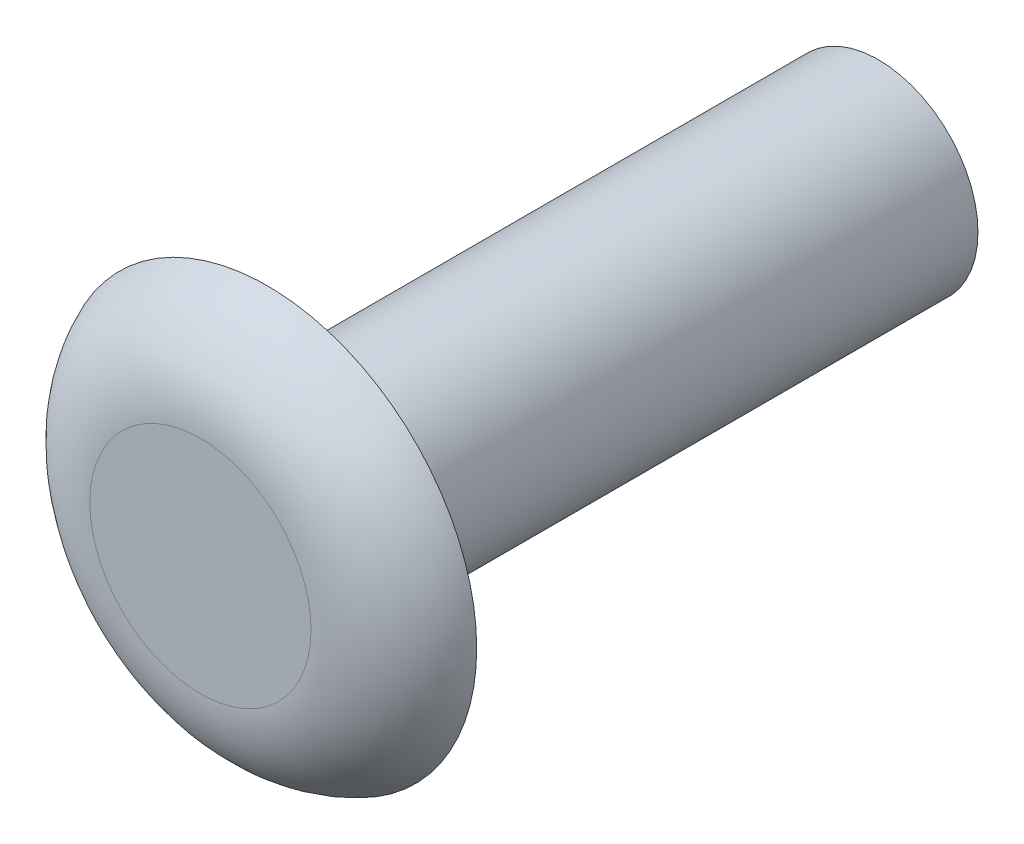
ISO-10303-21;
HEADER;
FILE_DESCRIPTION(('STEP AP214'),'2;1');
FILE_NAME('part.step','',(''),(''),'','','');
FILE_SCHEMA(('AUTOMOTIVE_DESIGN { 1 0 10303 214 1 1 1 1 }'));
ENDSEC;
DATA;
#1=APPLICATION_CONTEXT('core data for automotive mechanical design processes');
#2=APPLICATION_PROTOCOL_DEFINITION('international standard','automotive_design',2000,#1);
#3=PRODUCT_CONTEXT('',#1,'mechanical');
#4=PRODUCT('Part','Part','',(#3));
#5=PRODUCT_RELATED_PRODUCT_CATEGORY('part','',(#4));
#6=PRODUCT_DEFINITION_FORMATION('','',#4);
#7=PRODUCT_DEFINITION_CONTEXT('part definition',#1,'design');
#8=PRODUCT_DEFINITION('design','',#6,#7);
#9=PRODUCT_DEFINITION_SHAPE('','',#8);
#10=(LENGTH_UNIT() NAMED_UNIT(*) SI_UNIT(.MILLI.,.METRE.));
#11=(NAMED_UNIT(*) PLANE_ANGLE_UNIT() SI_UNIT($,.RADIAN.));
#12=(NAMED_UNIT(*) SI_UNIT($,.STERADIAN.) SOLID_ANGLE_UNIT());
#13=UNCERTAINTY_MEASURE_WITH_UNIT(LENGTH_MEASURE(1.E-05),#10,'distance_accuracy_value','');
#14=(GEOMETRIC_REPRESENTATION_CONTEXT(3) GLOBAL_UNCERTAINTY_ASSIGNED_CONTEXT((#13)) GLOBAL_UNIT_ASSIGNED_CONTEXT((#10,
#11,#12)) REPRESENTATION_CONTEXT('',''));
#15=CARTESIAN_POINT('',(0.,0.,0.));
#16=DIRECTION('',(0.,0.,1.));
#17=DIRECTION('',(1.,0.,0.));
#18=AXIS2_PLACEMENT_3D('',#15,#16,#17);
#19=CARTESIAN_POINT('',(0.,0.,1.6002));
#20=DIRECTION('',(0.,0.,1.));
#21=DIRECTION('',(1.,0.,0.));
#22=AXIS2_PLACEMENT_3D('',#19,#20,#21);
#23=PLANE('',#22);
#24=CARTESIAN_POINT('',(0.,0.,1.6002));
#25=DIRECTION('',(0.,0.,1.));
#26=DIRECTION('',(1.,0.,0.));
#27=AXIS2_PLACEMENT_3D('',#24,#25,#26);
#28=CIRCLE('',#27,2.64405934475841);
#29=CARTESIAN_POINT('',(2.64405934475841,0.,1.6002));
#30=VERTEX_POINT('',#29);
#31=EDGE_CURVE('E10',#30,#30,#28,.T.);
#32=ORIENTED_EDGE('',*,*,#31,.T.);
#33=EDGE_LOOP('',(#32));
#34=FACE_BOUND('',#33,.T.);
#35=ADVANCED_FACE('F32',(#34),#23,.T.);
#36=CARTESIAN_POINT('',(0.,0.,0.));
#37=DIRECTION('',(0.,0.,1.));
#38=DIRECTION('',(1.,0.,0.));
#39=AXIS2_PLACEMENT_3D('',#36,#37,#38);
#40=PLANE('',#39);
#41=CARTESIAN_POINT('',(0.,0.,0.));
#42=DIRECTION('',(0.,0.,1.));
#43=DIRECTION('',(1.,0.,0.));
#44=AXIS2_PLACEMENT_3D('',#41,#42,#43);
#45=CIRCLE('',#44,2.38125);
#46=CARTESIAN_POINT('',(2.38125,0.,0.));
#47=VERTEX_POINT('',#46);
#48=EDGE_CURVE('E47',#47,#47,#45,.T.);
#49=ORIENTED_EDGE('',*,*,#48,.T.);
#50=EDGE_LOOP('',(#49));
#51=FACE_BOUND('',#50,.T.);
#52=CARTESIAN_POINT('',(0.,0.,0.));
#53=DIRECTION('',(0.,0.,1.));
#54=DIRECTION('',(1.,0.,0.));
#55=AXIS2_PLACEMENT_3D('',#52,#53,#54);
#56=CIRCLE('',#55,5.0038);
#57=CARTESIAN_POINT('',(5.0038,0.,0.));
#58=VERTEX_POINT('',#57);
#59=EDGE_CURVE('E39',#58,#58,#56,.T.);
#60=ORIENTED_EDGE('',*,*,#59,.F.);
#61=EDGE_LOOP('',(#60));
#62=FACE_BOUND('',#61,.T.);
#63=ADVANCED_FACE('F53',(#51,#62),#40,.F.);
#64=CARTESIAN_POINT('',(0.,0.,-14.605));
#65=DIRECTION('',(0.,0.,1.));
#66=DIRECTION('',(1.,0.,0.));
#67=AXIS2_PLACEMENT_3D('',#64,#65,#66);
#68=CYLINDRICAL_SURFACE('',#67,2.38125);
#69=CARTESIAN_POINT('',(0.,0.,-14.605));
#70=DIRECTION('',(0.,0.,1.));
#71=DIRECTION('',(1.,0.,0.));
#72=AXIS2_PLACEMENT_3D('',#69,#70,#71);
#73=CIRCLE('',#72,2.38125);
#74=CARTESIAN_POINT('',(2.38125,0.,-14.605));
#75=VERTEX_POINT('',#74);
#76=EDGE_CURVE('E43',#75,#75,#73,.T.);
#77=CARTESIAN_POINT('',(2.38125,0.,-14.605));
#78=CARTESIAN_POINT('',(2.38125,0.,-14.4528645833333));
#79=CARTESIAN_POINT('',(2.38125,0.,-14.3007291666667));
#80=CARTESIAN_POINT('',(2.38125,0.,-13.9964583333333));
#81=CARTESIAN_POINT('',(2.38125,0.,-13.8443229166667));
#82=CARTESIAN_POINT('',(2.38125,0.,-13.5400520833333));
#83=CARTESIAN_POINT('',(2.38125,0.,-13.3879166666667));
#84=CARTESIAN_POINT('',(2.38125,0.,-13.0836458333333));
#85=CARTESIAN_POINT('',(2.38125,0.,-12.9315104166667));
#86=CARTESIAN_POINT('',(2.38125,0.,-12.6272395833333));
#87=CARTESIAN_POINT('',(2.38125,0.,-12.4751041666667));
#88=CARTESIAN_POINT('',(2.38125,0.,-12.1708333333333));
#89=CARTESIAN_POINT('',(2.38125,0.,-12.0186979166667));
#90=CARTESIAN_POINT('',(2.38125,0.,-11.7144270833333));
#91=CARTESIAN_POINT('',(2.38125,0.,-11.5622916666667));
#92=CARTESIAN_POINT('',(2.38125,0.,-11.2580208333333));
#93=CARTESIAN_POINT('',(2.38125,0.,-11.1058854166667));
#94=CARTESIAN_POINT('',(2.38125,0.,-10.8016145833333));
#95=CARTESIAN_POINT('',(2.38125,0.,-10.6494791666667));
#96=CARTESIAN_POINT('',(2.38125,0.,-10.3452083333333));
#97=CARTESIAN_POINT('',(2.38125,0.,-10.1930729166667));
#98=CARTESIAN_POINT('',(2.38125,0.,-9.88880208333333));
#99=CARTESIAN_POINT('',(2.38125,0.,-9.73666666666667));
#100=CARTESIAN_POINT('',(2.38125,0.,-9.43239583333333));
#101=CARTESIAN_POINT('',(2.38125,0.,-9.28026041666667));
#102=CARTESIAN_POINT('',(2.38125,0.,-8.97598958333333));
#103=CARTESIAN_POINT('',(2.38125,0.,-8.82385416666667));
#104=CARTESIAN_POINT('',(2.38125,0.,-8.51958333333333));
#105=CARTESIAN_POINT('',(2.38125,0.,-8.36744791666667));
#106=CARTESIAN_POINT('',(2.38125,0.,-8.06317708333333));
#107=CARTESIAN_POINT('',(2.38125,0.,-7.91104166666667));
#108=CARTESIAN_POINT('',(2.38125,0.,-7.60677083333333));
#109=CARTESIAN_POINT('',(2.38125,0.,-7.45463541666667));
#110=CARTESIAN_POINT('',(2.38125,0.,-7.15036458333333));
#111=CARTESIAN_POINT('',(2.38125,0.,-6.99822916666667));
#112=CARTESIAN_POINT('',(2.38125,0.,-6.69395833333333));
#113=CARTESIAN_POINT('',(2.38125,0.,-6.54182291666667));
#114=CARTESIAN_POINT('',(2.38125,0.,-6.23755208333333));
#115=CARTESIAN_POINT('',(2.38125,0.,-6.08541666666667));
#116=CARTESIAN_POINT('',(2.38125,0.,-5.78114583333333));
#117=CARTESIAN_POINT('',(2.38125,0.,-5.62901041666667));
#118=CARTESIAN_POINT('',(2.38125,0.,-5.32473958333333));
#119=CARTESIAN_POINT('',(2.38125,0.,-5.17260416666667));
#120=CARTESIAN_POINT('',(2.38125,0.,-4.86833333333333));
#121=CARTESIAN_POINT('',(2.38125,0.,-4.71619791666667));
#122=CARTESIAN_POINT('',(2.38125,0.,-4.41192708333333));
#123=CARTESIAN_POINT('',(2.38125,0.,-4.25979166666667));
#124=CARTESIAN_POINT('',(2.38125,0.,-3.95552083333333));
#125=CARTESIAN_POINT('',(2.38125,0.,-3.80338541666667));
#126=CARTESIAN_POINT('',(2.38125,0.,-3.49911458333333));
#127=CARTESIAN_POINT('',(2.38125,0.,-3.34697916666667));
#128=CARTESIAN_POINT('',(2.38125,0.,-3.04270833333333));
#129=CARTESIAN_POINT('',(2.38125,0.,-2.89057291666667));
#130=CARTESIAN_POINT('',(2.38125,0.,-2.58630208333333));
#131=CARTESIAN_POINT('',(2.38125,0.,-2.43416666666667));
#132=CARTESIAN_POINT('',(2.38125,0.,-2.12989583333333));
#133=CARTESIAN_POINT('',(2.38125,0.,-1.97776041666667));
#134=CARTESIAN_POINT('',(2.38125,0.,-1.67348958333333));
#135=CARTESIAN_POINT('',(2.38125,0.,-1.52135416666667));
#136=CARTESIAN_POINT('',(2.38125,0.,-1.21708333333333));
#137=CARTESIAN_POINT('',(2.38125,0.,-1.06494791666667));
#138=CARTESIAN_POINT('',(2.38125,0.,-0.760677083333333));
#139=CARTESIAN_POINT('',(2.38125,0.,-0.608541666666666));
#140=CARTESIAN_POINT('',(2.38125,0.,-0.304270833333333));
#141=CARTESIAN_POINT('',(2.38125,0.,-0.152135416666666));
#142=CARTESIAN_POINT('',(2.38125,0.,0.));
#143=B_SPLINE_CURVE_WITH_KNOTS('',3,(#77,#78,#79,#80,#81,#82,#83,#84,#85,#86,#87,#88,#89,#90,
#91,#92,#93,#94,#95,#96,#97,#98,#99,#100,#101,#102,#103,#104,#105,#106,#107,#108,#109,#110,#111,
#112,#113,#114,#115,#116,#117,#118,#119,#120,#121,#122,#123,#124,#125,#126,#127,#128,#129,#130,
#131,#132,#133,#134,#135,#136,#137,#138,#139,#140,#141,#142),.UNSPECIFIED.,.F.,.F.,(4,2,2,2,2,2,
2,2,2,2,2,2,2,2,2,2,2,2,2,2,2,2,2,2,2,2,2,2,2,2,2,2,4),(0.,0.456406249999999,0.912812499999999,
1.36921875,1.825625,2.28203125,2.7384375,3.19484375,3.65125,4.10765625,4.5640625,5.02046875,
5.476875,5.93328125,6.3896875,6.84609375,7.3025,7.75890625,8.2153125,8.67171875,9.128125,
9.58453125,10.0409375,10.49734375,10.95375,11.41015625,11.8665625,12.32296875,12.779375,
13.23578125,13.6921875,14.14859375,14.605),.UNSPECIFIED.);
#144=EDGE_CURVE('BSEAM56',#75,#47,#143,.T.);
#145=ORIENTED_EDGE('',*,*,#76,.T.);
#146=ORIENTED_EDGE('',*,*,#48,.F.);
#147=ORIENTED_EDGE('',*,*,#144,.T.);
#148=ORIENTED_EDGE('',*,*,#144,.F.);
#149=EDGE_LOOP('',(#145,#147,#146,#148));
#150=FACE_BOUND('',#149,.T.);
#151=ADVANCED_FACE('F56',(#150),#68,.T.);
#152=CARTESIAN_POINT('',(0.,0.,-14.605));
#153=DIRECTION('',(0.,0.,1.));
#154=DIRECTION('',(1.,0.,0.));
#155=AXIS2_PLACEMENT_3D('',#152,#153,#154);
#156=PLANE('',#155);
#157=ORIENTED_EDGE('',*,*,#76,.F.);
#158=EDGE_LOOP('',(#157));
#159=FACE_BOUND('',#158,.T.);
#160=ADVANCED_FACE('F58',(#159),#156,.F.);
#161=CARTESIAN_POINT('',(0.,0.,-0.9398));
#162=DIRECTION('',(0.,0.,-1.));
#163=DIRECTION('',(-1.,0.,0.));
#164=AXIS2_PLACEMENT_3D('',#161,#162,#163);
#165=TOROIDAL_SURFACE('',#164,2.64405934475841,2.54);
#166=ORIENTED_EDGE('',*,*,#59,.T.);
#167=EDGE_LOOP('',(#166));
#168=FACE_BOUND('',#167,.T.);
#169=ORIENTED_EDGE('',*,*,#31,.F.);
#170=EDGE_LOOP('',(#169));
#171=FACE_BOUND('',#170,.T.);
#172=ADVANCED_FACE('F34',(#168,#171),#165,.T.);
#173=CLOSED_SHELL('',(#35,#63,#151,#160,#172));
#174=MANIFOLD_SOLID_BREP('B2',#173);
#175=ADVANCED_BREP_SHAPE_REPRESENTATION('',(#18,#174),#14);
#176=SHAPE_DEFINITION_REPRESENTATION(#9,#175);
ENDSEC;
END-ISO-10303-21;
